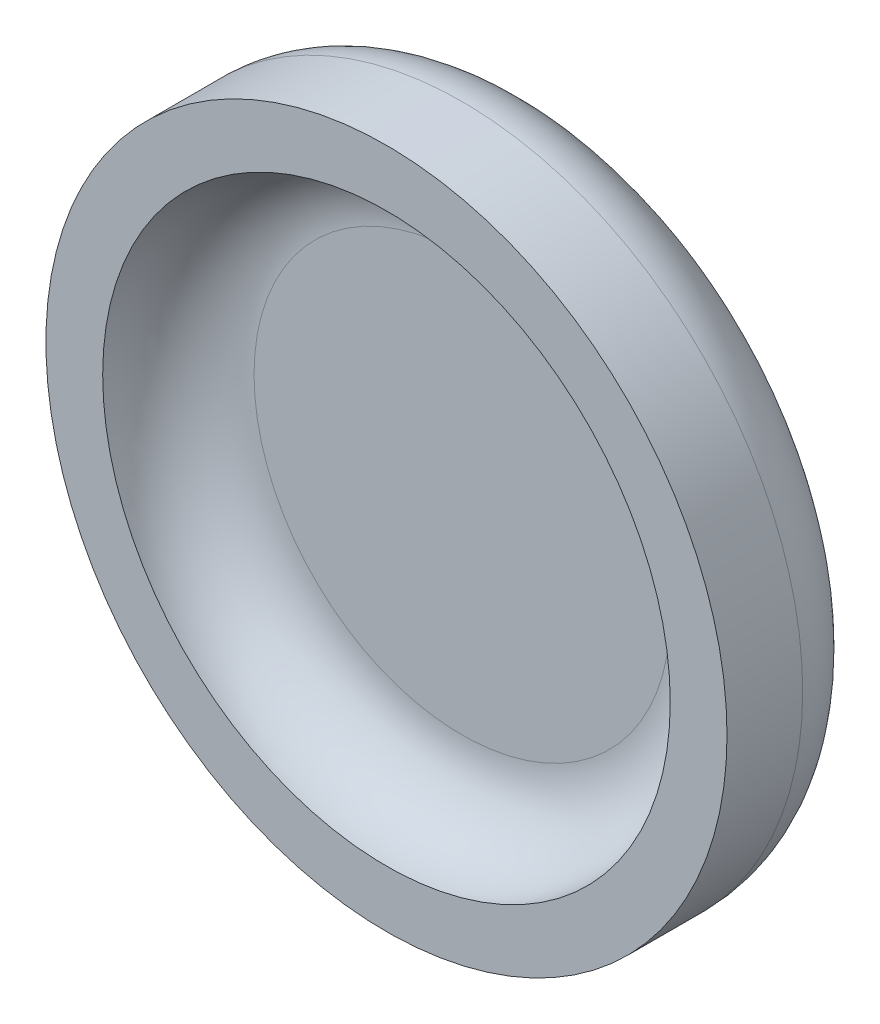
ISO-10303-21;
HEADER;
FILE_DESCRIPTION(('STEP AP214'),'2;1');
FILE_NAME('part.step','',(''),(''),'','','');
FILE_SCHEMA(('AUTOMOTIVE_DESIGN { 1 0 10303 214 1 1 1 1 }'));
ENDSEC;
DATA;
#1=APPLICATION_CONTEXT('core data for automotive mechanical design processes');
#2=APPLICATION_PROTOCOL_DEFINITION('international standard','automotive_design',2000,#1);
#3=PRODUCT_CONTEXT('',#1,'mechanical');
#4=PRODUCT('Part','Part','',(#3));
#5=PRODUCT_RELATED_PRODUCT_CATEGORY('part','',(#4));
#6=PRODUCT_DEFINITION_FORMATION('','',#4);
#7=PRODUCT_DEFINITION_CONTEXT('part definition',#1,'design');
#8=PRODUCT_DEFINITION('design','',#6,#7);
#9=PRODUCT_DEFINITION_SHAPE('','',#8);
#10=(LENGTH_UNIT() NAMED_UNIT(*) SI_UNIT(.MILLI.,.METRE.));
#11=(NAMED_UNIT(*) PLANE_ANGLE_UNIT() SI_UNIT($,.RADIAN.));
#12=(NAMED_UNIT(*) SI_UNIT($,.STERADIAN.) SOLID_ANGLE_UNIT());
#13=UNCERTAINTY_MEASURE_WITH_UNIT(LENGTH_MEASURE(1.E-05),#10,'distance_accuracy_value','');
#14=(GEOMETRIC_REPRESENTATION_CONTEXT(3) GLOBAL_UNCERTAINTY_ASSIGNED_CONTEXT((#13)) GLOBAL_UNIT_ASSIGNED_CONTEXT((#10,
#11,#12)) REPRESENTATION_CONTEXT('',''));
#15=CARTESIAN_POINT('',(0.,0.,0.));
#16=DIRECTION('',(0.,0.,1.));
#17=DIRECTION('',(1.,0.,0.));
#18=AXIS2_PLACEMENT_3D('',#15,#16,#17);
#19=CARTESIAN_POINT('',(0.,0.,4.));
#20=DIRECTION('',(0.,0.,-1.));
#21=DIRECTION('',(-1.,0.,0.));
#22=AXIS2_PLACEMENT_3D('',#19,#20,#21);
#23=CYLINDRICAL_SURFACE('',#22,9.);
#24=CARTESIAN_POINT('',(0.,0.,2.));
#25=DIRECTION('',(0.,0.,1.));
#26=DIRECTION('',(1.,0.,0.));
#27=AXIS2_PLACEMENT_3D('',#24,#25,#26);
#28=CIRCLE('',#27,9.);
#29=CARTESIAN_POINT('',(9.,0.,2.));
#30=VERTEX_POINT('',#29);
#31=EDGE_CURVE('E47',#30,#30,#28,.T.);
#32=ORIENTED_EDGE('',*,*,#31,.T.);
#33=EDGE_LOOP('',(#32));
#34=FACE_BOUND('',#33,.T.);
#35=CARTESIAN_POINT('',(0.,0.,4.));
#36=DIRECTION('',(0.,0.,1.));
#37=DIRECTION('',(1.,0.,0.));
#38=AXIS2_PLACEMENT_3D('',#35,#36,#37);
#39=CIRCLE('',#38,9.);
#40=CARTESIAN_POINT('',(9.,0.,4.));
#41=VERTEX_POINT('',#40);
#42=EDGE_CURVE('E51',#41,#41,#39,.T.);
#43=ORIENTED_EDGE('',*,*,#42,.F.);
#44=EDGE_LOOP('',(#43));
#45=FACE_BOUND('',#44,.T.);
#46=ADVANCED_FACE('F36',(#34,#45),#23,.T.);
#47=CARTESIAN_POINT('',(0.,0.,4.));
#48=DIRECTION('',(0.,0.,1.));
#49=DIRECTION('',(1.,0.,0.));
#50=AXIS2_PLACEMENT_3D('',#47,#48,#49);
#51=PLANE('',#50);
#52=CARTESIAN_POINT('',(0.,0.,4.));
#53=DIRECTION('',(0.,0.,1.));
#54=DIRECTION('',(1.,0.,0.));
#55=AXIS2_PLACEMENT_3D('',#52,#53,#54);
#56=CIRCLE('',#55,7.5);
#57=CARTESIAN_POINT('',(7.5,0.,4.));
#58=VERTEX_POINT('',#57);
#59=EDGE_CURVE('E56',#58,#58,#56,.T.);
#60=ORIENTED_EDGE('',*,*,#59,.F.);
#61=EDGE_LOOP('',(#60));
#62=FACE_BOUND('',#61,.T.);
#63=ORIENTED_EDGE('',*,*,#42,.T.);
#64=EDGE_LOOP('',(#63));
#65=FACE_BOUND('',#64,.T.);
#66=ADVANCED_FACE('F62',(#62,#65),#51,.T.);
#67=CARTESIAN_POINT('',(0.,0.,0.));
#68=DIRECTION('',(0.,0.,1.));
#69=DIRECTION('',(1.,0.,0.));
#70=AXIS2_PLACEMENT_3D('',#67,#68,#69);
#71=PLANE('',#70);
#72=CARTESIAN_POINT('',(0.,0.,0.));
#73=DIRECTION('',(0.,0.,1.));
#74=DIRECTION('',(1.,0.,0.));
#75=AXIS2_PLACEMENT_3D('',#72,#73,#74);
#76=CIRCLE('',#75,7.);
#77=CARTESIAN_POINT('',(7.,0.,0.));
#78=VERTEX_POINT('',#77);
#79=EDGE_CURVE('E43',#78,#78,#76,.F.);
#80=ORIENTED_EDGE('',*,*,#79,.T.);
#81=EDGE_LOOP('',(#80));
#82=FACE_BOUND('',#81,.T.);
#83=ADVANCED_FACE('F65',(#82),#71,.F.);
#84=CARTESIAN_POINT('',(0.,0.,2.));
#85=DIRECTION('',(0.,0.,1.));
#86=DIRECTION('',(1.,0.,0.));
#87=AXIS2_PLACEMENT_3D('',#84,#85,#86);
#88=PLANE('',#87);
#89=CARTESIAN_POINT('',(0.,0.,2.));
#90=DIRECTION('',(0.,0.,1.));
#91=DIRECTION('',(1.,0.,0.));
#92=AXIS2_PLACEMENT_3D('',#89,#90,#91);
#93=CIRCLE('',#92,5.5);
#94=CARTESIAN_POINT('',(5.5,0.,2.));
#95=VERTEX_POINT('',#94);
#96=EDGE_CURVE('E10',#95,#95,#93,.T.);
#97=ORIENTED_EDGE('',*,*,#96,.T.);
#98=EDGE_LOOP('',(#97));
#99=FACE_BOUND('',#98,.T.);
#100=ADVANCED_FACE('F77',(#99),#88,.T.);
#101=CARTESIAN_POINT('',(0.,0.,2.));
#102=DIRECTION('',(0.,0.,1.));
#103=DIRECTION('',(1.,0.,0.));
#104=AXIS2_PLACEMENT_3D('',#101,#102,#103);
#105=TOROIDAL_SURFACE('',#104,7.,2.);
#106=ORIENTED_EDGE('',*,*,#79,.F.);
#107=EDGE_LOOP('',(#106));
#108=FACE_BOUND('',#107,.T.);
#109=ORIENTED_EDGE('',*,*,#31,.F.);
#110=EDGE_LOOP('',(#109));
#111=FACE_BOUND('',#110,.T.);
#112=ADVANCED_FACE('F75',(#108,#111),#105,.T.);
#113=CARTESIAN_POINT('',(0.,0.,4.));
#114=DIRECTION('',(0.,0.,1.));
#115=DIRECTION('',(1.,0.,0.));
#116=AXIS2_PLACEMENT_3D('',#113,#114,#115);
#117=TOROIDAL_SURFACE('',#116,5.5,2.);
#118=ORIENTED_EDGE('',*,*,#59,.T.);
#119=EDGE_LOOP('',(#118));
#120=FACE_BOUND('',#119,.T.);
#121=ORIENTED_EDGE('',*,*,#96,.F.);
#122=EDGE_LOOP('',(#121));
#123=FACE_BOUND('',#122,.T.);
#124=ADVANCED_FACE('F38',(#120,#123),#117,.F.);
#125=CLOSED_SHELL('',(#46,#66,#83,#100,#112,#124));
#126=MANIFOLD_SOLID_BREP('B2',#125);
#127=ADVANCED_BREP_SHAPE_REPRESENTATION('',(#18,#126),#14);
#128=SHAPE_DEFINITION_REPRESENTATION(#9,#127);
ENDSEC;
END-ISO-10303-21;
